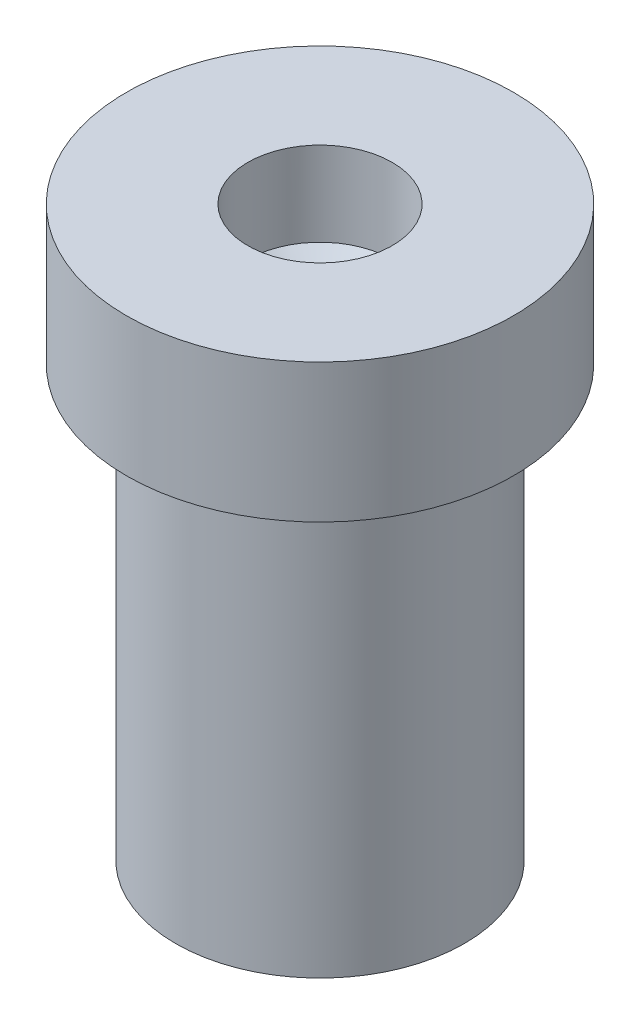
ISO-10303-21;
HEADER;
FILE_DESCRIPTION(('STEP AP214'),'2;1');
FILE_NAME('part.step','',(''),(''),'','','');
FILE_SCHEMA(('AUTOMOTIVE_DESIGN { 1 0 10303 214 1 1 1 1 }'));
ENDSEC;
DATA;
#1=APPLICATION_CONTEXT('core data for automotive mechanical design processes');
#2=APPLICATION_PROTOCOL_DEFINITION('international standard','automotive_design',2000,#1);
#3=PRODUCT_CONTEXT('',#1,'mechanical');
#4=PRODUCT('Part','Part','',(#3));
#5=PRODUCT_RELATED_PRODUCT_CATEGORY('part','',(#4));
#6=PRODUCT_DEFINITION_FORMATION('','',#4);
#7=PRODUCT_DEFINITION_CONTEXT('part definition',#1,'design');
#8=PRODUCT_DEFINITION('design','',#6,#7);
#9=PRODUCT_DEFINITION_SHAPE('','',#8);
#10=(LENGTH_UNIT() NAMED_UNIT(*) SI_UNIT(.MILLI.,.METRE.));
#11=(NAMED_UNIT(*) PLANE_ANGLE_UNIT() SI_UNIT($,.RADIAN.));
#12=(NAMED_UNIT(*) SI_UNIT($,.STERADIAN.) SOLID_ANGLE_UNIT());
#13=UNCERTAINTY_MEASURE_WITH_UNIT(LENGTH_MEASURE(1.E-05),#10,'distance_accuracy_value','');
#14=(GEOMETRIC_REPRESENTATION_CONTEXT(3) GLOBAL_UNCERTAINTY_ASSIGNED_CONTEXT((#13)) GLOBAL_UNIT_ASSIGNED_CONTEXT((#10,
#11,#12)) REPRESENTATION_CONTEXT('',''));
#15=CARTESIAN_POINT('',(0.,0.,0.));
#16=DIRECTION('',(0.,0.,1.));
#17=DIRECTION('',(1.,0.,0.));
#18=AXIS2_PLACEMENT_3D('',#15,#16,#17);
#19=CARTESIAN_POINT('',(0.,-10.425,0.));
#20=DIRECTION('',(0.,-1.,0.));
#21=DIRECTION('',(0.,0.,-1.));
#22=AXIS2_PLACEMENT_3D('',#19,#20,#21);
#23=PLANE('',#22);
#24=CARTESIAN_POINT('',(0.,-10.425,0.));
#25=DIRECTION('',(0.,-1.,0.));
#26=DIRECTION('',(0.,0.,-1.));
#27=AXIS2_PLACEMENT_3D('',#24,#25,#26);
#28=CIRCLE('',#27,4.1);
#29=CARTESIAN_POINT('',(0.,-10.425,-4.1));
#30=VERTEX_POINT('',#29);
#31=EDGE_CURVE('E11',#30,#30,#28,.T.);
#32=ORIENTED_EDGE('',*,*,#31,.T.);
#33=EDGE_LOOP('',(#32));
#34=FACE_BOUND('',#33,.T.);
#35=ADVANCED_FACE('F39',(#34),#23,.T.);
#36=CARTESIAN_POINT('',(0.,-10.425,0.));
#37=DIRECTION('',(0.,-1.,0.));
#38=DIRECTION('',(0.,0.,-1.));
#39=AXIS2_PLACEMENT_3D('',#36,#37,#38);
#40=CYLINDRICAL_SURFACE('',#39,4.1);
#41=CARTESIAN_POINT('',(0.,1.77500000000002,0.));
#42=DIRECTION('',(0.,-1.,0.));
#43=DIRECTION('',(0.,0.,-1.));
#44=AXIS2_PLACEMENT_3D('',#41,#42,#43);
#45=CIRCLE('',#44,4.1);
#46=CARTESIAN_POINT('',(0.,1.77500000000002,-4.1));
#47=VERTEX_POINT('',#46);
#48=EDGE_CURVE('E46',#47,#47,#45,.T.);
#49=ORIENTED_EDGE('',*,*,#48,.T.);
#50=EDGE_LOOP('',(#49));
#51=FACE_BOUND('',#50,.T.);
#52=ORIENTED_EDGE('',*,*,#31,.F.);
#53=EDGE_LOOP('',(#52));
#54=FACE_BOUND('',#53,.T.);
#55=ADVANCED_FACE('F76',(#51,#54),#40,.T.);
#56=CARTESIAN_POINT('',(4.1,1.77500000000002,0.));
#57=DIRECTION('',(0.,-1.,0.));
#58=DIRECTION('',(0.,0.,-1.));
#59=AXIS2_PLACEMENT_3D('',#56,#57,#58);
#60=PLANE('',#59);
#61=CARTESIAN_POINT('',(0.,1.77500000000002,0.));
#62=DIRECTION('',(0.,-1.,0.));
#63=DIRECTION('',(0.,0.,-1.));
#64=AXIS2_PLACEMENT_3D('',#61,#62,#63);
#65=CIRCLE('',#64,5.49541345719356);
#66=CARTESIAN_POINT('',(0.,1.77500000000002,-5.49541345719356));
#67=VERTEX_POINT('',#66);
#68=EDGE_CURVE('E69',#67,#67,#65,.T.);
#69=ORIENTED_EDGE('',*,*,#68,.T.);
#70=EDGE_LOOP('',(#69));
#71=FACE_BOUND('',#70,.T.);
#72=ORIENTED_EDGE('',*,*,#48,.F.);
#73=EDGE_LOOP('',(#72));
#74=FACE_BOUND('',#73,.T.);
#75=ADVANCED_FACE('F79',(#71,#74),#60,.T.);
#76=CARTESIAN_POINT('',(0.,-10.425,0.));
#77=DIRECTION('',(0.,-1.,0.));
#78=DIRECTION('',(0.,0.,-1.));
#79=AXIS2_PLACEMENT_3D('',#76,#77,#78);
#80=CYLINDRICAL_SURFACE('',#79,5.49541345719356);
#81=CARTESIAN_POINT('',(0.,5.71021691107175,0.));
#82=DIRECTION('',(0.,-1.,0.));
#83=DIRECTION('',(0.,0.,-1.));
#84=AXIS2_PLACEMENT_3D('',#81,#82,#83);
#85=CIRCLE('',#84,5.49541345719356);
#86=CARTESIAN_POINT('',(0.,5.71021691107175,-5.49541345719356));
#87=VERTEX_POINT('',#86);
#88=EDGE_CURVE('E63',#87,#87,#85,.T.);
#89=ORIENTED_EDGE('',*,*,#88,.T.);
#90=EDGE_LOOP('',(#89));
#91=FACE_BOUND('',#90,.T.);
#92=ORIENTED_EDGE('',*,*,#68,.F.);
#93=EDGE_LOOP('',(#92));
#94=FACE_BOUND('',#93,.T.);
#95=ADVANCED_FACE('F81',(#91,#94),#80,.T.);
#96=CARTESIAN_POINT('',(5.49541345719356,5.71021691107175,0.));
#97=DIRECTION('',(0.,1.,0.));
#98=DIRECTION('',(0.,0.,1.));
#99=AXIS2_PLACEMENT_3D('',#96,#97,#98);
#100=PLANE('',#99);
#101=CARTESIAN_POINT('',(0.,5.71021691107175,0.));
#102=DIRECTION('',(0.,-1.,0.));
#103=DIRECTION('',(0.,0.,-1.));
#104=AXIS2_PLACEMENT_3D('',#101,#102,#103);
#105=CIRCLE('',#104,2.05);
#106=CARTESIAN_POINT('',(0.,5.71021691107175,-2.05));
#107=VERTEX_POINT('',#106);
#108=EDGE_CURVE('E59',#107,#107,#105,.T.);
#109=ORIENTED_EDGE('',*,*,#108,.T.);
#110=EDGE_LOOP('',(#109));
#111=FACE_BOUND('',#110,.T.);
#112=ORIENTED_EDGE('',*,*,#88,.F.);
#113=EDGE_LOOP('',(#112));
#114=FACE_BOUND('',#113,.T.);
#115=ADVANCED_FACE('F88',(#111,#114),#100,.T.);
#116=CARTESIAN_POINT('',(0.,-10.425,0.));
#117=DIRECTION('',(0.,-1.,0.));
#118=DIRECTION('',(0.,0.,-1.));
#119=AXIS2_PLACEMENT_3D('',#116,#117,#118);
#120=CYLINDRICAL_SURFACE('',#119,2.05);
#121=CARTESIAN_POINT('',(0.,3.32089693441986,0.));
#122=DIRECTION('',(0.,-1.,0.));
#123=DIRECTION('',(0.,0.,-1.));
#124=AXIS2_PLACEMENT_3D('',#121,#122,#123);
#125=CIRCLE('',#124,2.05);
#126=CARTESIAN_POINT('',(0.,3.32089693441986,-2.05));
#127=VERTEX_POINT('',#126);
#128=EDGE_CURVE('E56',#127,#127,#125,.T.);
#129=ORIENTED_EDGE('',*,*,#128,.T.);
#130=EDGE_LOOP('',(#129));
#131=FACE_BOUND('',#130,.T.);
#132=ORIENTED_EDGE('',*,*,#108,.F.);
#133=EDGE_LOOP('',(#132));
#134=FACE_BOUND('',#133,.T.);
#135=ADVANCED_FACE('F52',(#131,#134),#120,.F.);
#136=CARTESIAN_POINT('',(0.,3.32089693441986,0.));
#137=DIRECTION('',(0.,1.,0.));
#138=DIRECTION('',(0.,0.,1.));
#139=AXIS2_PLACEMENT_3D('',#136,#137,#138);
#140=CONICAL_SURFACE('',#139,2.05,0.924678886018244);
#141=CARTESIAN_POINT('',(0.,1.77500000000002,0.));
#142=VERTEX_POINT('',#141);
#143=VERTEX_LOOP('',#142);
#144=FACE_BOUND('',#143,.T.);
#145=ORIENTED_EDGE('',*,*,#128,.F.);
#146=EDGE_LOOP('',(#145));
#147=FACE_BOUND('',#146,.T.);
#148=ADVANCED_FACE('F49',(#144,#147),#140,.F.);
#149=CLOSED_SHELL('',(#35,#55,#75,#95,#115,#135,#148));
#150=MANIFOLD_SOLID_BREP('B2',#149);
#151=ADVANCED_BREP_SHAPE_REPRESENTATION('',(#18,#150),#14);
#152=SHAPE_DEFINITION_REPRESENTATION(#9,#151);
ENDSEC;
END-ISO-10303-21;
